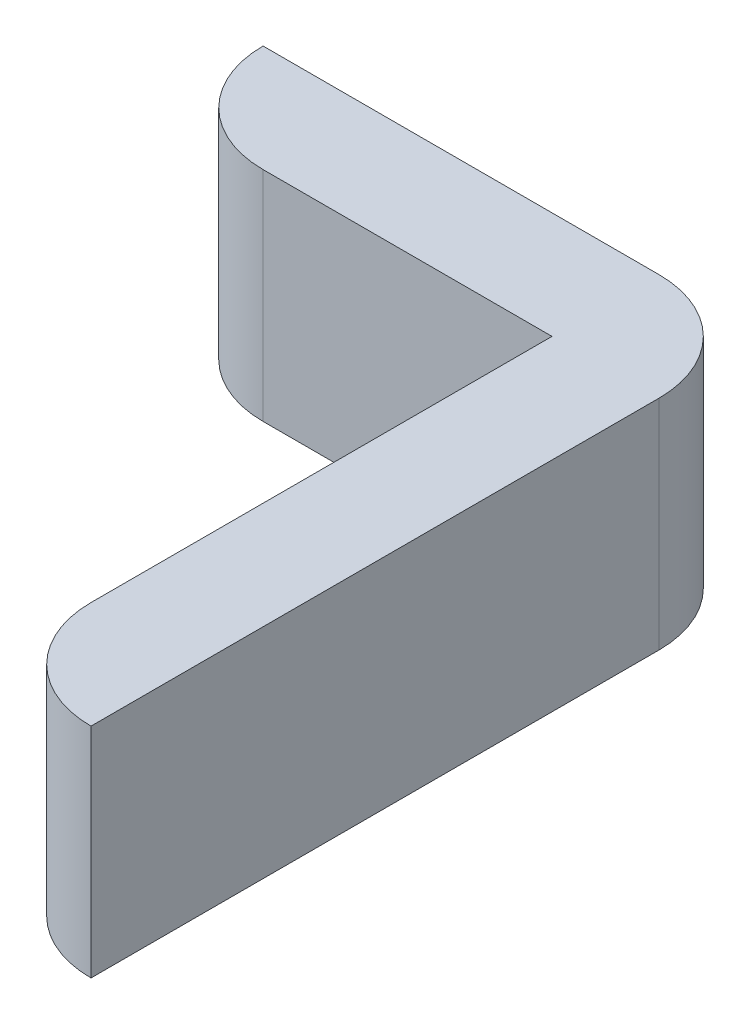
ISO-10303-21;
HEADER;
FILE_DESCRIPTION(('STEP AP214'),'2;1');
FILE_NAME('part.step','',(''),(''),'','','');
FILE_SCHEMA(('AUTOMOTIVE_DESIGN { 1 0 10303 214 1 1 1 1 }'));
ENDSEC;
DATA;
#1=APPLICATION_CONTEXT('core data for automotive mechanical design processes');
#2=APPLICATION_PROTOCOL_DEFINITION('international standard','automotive_design',2000,#1);
#3=PRODUCT_CONTEXT('',#1,'mechanical');
#4=PRODUCT('Part','Part','',(#3));
#5=PRODUCT_RELATED_PRODUCT_CATEGORY('part','',(#4));
#6=PRODUCT_DEFINITION_FORMATION('','',#4);
#7=PRODUCT_DEFINITION_CONTEXT('part definition',#1,'design');
#8=PRODUCT_DEFINITION('design','',#6,#7);
#9=PRODUCT_DEFINITION_SHAPE('','',#8);
#10=(LENGTH_UNIT() NAMED_UNIT(*) SI_UNIT(.MILLI.,.METRE.));
#11=(NAMED_UNIT(*) PLANE_ANGLE_UNIT() SI_UNIT($,.RADIAN.));
#12=(NAMED_UNIT(*) SI_UNIT($,.STERADIAN.) SOLID_ANGLE_UNIT());
#13=UNCERTAINTY_MEASURE_WITH_UNIT(LENGTH_MEASURE(1.E-05),#10,'distance_accuracy_value','');
#14=(GEOMETRIC_REPRESENTATION_CONTEXT(3) GLOBAL_UNCERTAINTY_ASSIGNED_CONTEXT((#13)) GLOBAL_UNIT_ASSIGNED_CONTEXT((#10,
#11,#12)) REPRESENTATION_CONTEXT('',''));
#15=CARTESIAN_POINT('',(0.,0.,0.));
#16=DIRECTION('',(0.,0.,1.));
#17=DIRECTION('',(1.,0.,0.));
#18=AXIS2_PLACEMENT_3D('',#15,#16,#17);
#19=CARTESIAN_POINT('',(-0.125,5.3348,0.));
#20=DIRECTION('',(0.,-1.,0.));
#21=DIRECTION('',(0.,0.,-1.));
#22=AXIS2_PLACEMENT_3D('',#19,#20,#21);
#23=PLANE('',#22);
#24=DIRECTION('',(-1.,0.,0.));
#25=VECTOR('',#24,1.);
#26=CARTESIAN_POINT('',(0.125,5.3348,0.25));
#27=LINE('',#26,#25);
#28=CARTESIAN_POINT('',(0.125,5.3348,0.25));
#29=VERTEX_POINT('',#28);
#30=CARTESIAN_POINT('',(0.8,5.3348,0.25));
#31=VERTEX_POINT('',#30);
#32=EDGE_CURVE('E102',#29,#31,#27,.F.);
#33=ORIENTED_EDGE('',*,*,#32,.T.);
#34=DIRECTION('',(0.,0.,-1.));
#35=VECTOR('',#34,1.);
#36=CARTESIAN_POINT('',(0.8,5.3348,0.25));
#37=LINE('',#36,#35);
#38=CARTESIAN_POINT('',(0.8,5.3348,1.327));
#39=VERTEX_POINT('',#38);
#40=EDGE_CURVE('E108',#31,#39,#37,.F.);
#41=ORIENTED_EDGE('',*,*,#40,.T.);
#42=CARTESIAN_POINT('',(1.05,5.3348,1.327));
#43=DIRECTION('',(0.,-1.,0.));
#44=DIRECTION('',(0.,0.,-1.));
#45=AXIS2_PLACEMENT_3D('',#42,#43,#44);
#46=CIRCLE('',#45,0.25);
#47=CARTESIAN_POINT('',(1.05,5.3348,1.577));
#48=VERTEX_POINT('',#47);
#49=EDGE_CURVE('E80',#48,#39,#46,.T.);
#50=ORIENTED_EDGE('',*,*,#49,.F.);
#51=DIRECTION('',(0.,0.,1.));
#52=VECTOR('',#51,1.);
#53=CARTESIAN_POINT('',(1.05,5.3348,1.577));
#54=LINE('',#53,#52);
#55=CARTESIAN_POINT('',(1.05,5.3348,0.25));
#56=VERTEX_POINT('',#55);
#57=EDGE_CURVE('E75',#48,#56,#54,.F.);
#58=ORIENTED_EDGE('',*,*,#57,.T.);
#59=CARTESIAN_POINT('',(0.8,5.3348,0.25));
#60=DIRECTION('',(0.,-1.,0.));
#61=DIRECTION('',(0.,0.,-1.));
#62=AXIS2_PLACEMENT_3D('',#59,#60,#61);
#63=CIRCLE('',#62,0.25);
#64=CARTESIAN_POINT('',(0.8,5.3348,0.));
#65=VERTEX_POINT('',#64);
#66=EDGE_CURVE('E19',#65,#56,#63,.T.);
#67=ORIENTED_EDGE('',*,*,#66,.F.);
#68=DIRECTION('',(1.,0.,0.));
#69=VECTOR('',#68,1.);
#70=CARTESIAN_POINT('',(0.8,5.3348,0.));
#71=LINE('',#70,#69);
#72=CARTESIAN_POINT('',(-0.125,5.3348,0.));
#73=VERTEX_POINT('',#72);
#74=EDGE_CURVE('E70',#65,#73,#71,.F.);
#75=ORIENTED_EDGE('',*,*,#74,.T.);
#76=CARTESIAN_POINT('',(0.125,5.3348,0.));
#77=DIRECTION('',(0.,-1.,0.));
#78=DIRECTION('',(0.,0.,-1.));
#79=AXIS2_PLACEMENT_3D('',#76,#77,#78);
#80=CIRCLE('',#79,0.25);
#81=EDGE_CURVE('E121',#29,#73,#80,.T.);
#82=ORIENTED_EDGE('',*,*,#81,.F.);
#83=EDGE_LOOP('',(#33,#41,#50,#58,#67,#75,#82));
#84=FACE_BOUND('',#83,.T.);
#85=ADVANCED_FACE('F16',(#84),#23,.F.);
#86=CARTESIAN_POINT('',(0.8,4.8252,0.));
#87=DIRECTION('',(0.,0.,1.));
#88=DIRECTION('',(1.,0.,0.));
#89=AXIS2_PLACEMENT_3D('',#86,#87,#88);
#90=PLANE('',#89);
#91=DIRECTION('',(0.,-1.,0.));
#92=VECTOR('',#91,1.);
#93=CARTESIAN_POINT('',(-0.125,4.8252,0.));
#94=LINE('',#93,#92);
#95=CARTESIAN_POINT('',(-0.125,4.8252,0.));
#96=VERTEX_POINT('',#95);
#97=EDGE_CURVE('E123',#73,#96,#94,.T.);
#98=ORIENTED_EDGE('',*,*,#97,.F.);
#99=ORIENTED_EDGE('',*,*,#74,.F.);
#100=DIRECTION('',(0.,-1.,0.));
#101=VECTOR('',#100,1.);
#102=CARTESIAN_POINT('',(0.8,4.8252,0.));
#103=LINE('',#102,#101);
#104=CARTESIAN_POINT('',(0.8,4.8252,0.));
#105=VERTEX_POINT('',#104);
#106=EDGE_CURVE('E92',#105,#65,#103,.F.);
#107=ORIENTED_EDGE('',*,*,#106,.F.);
#108=DIRECTION('',(1.,0.,0.));
#109=VECTOR('',#108,1.);
#110=CARTESIAN_POINT('',(-0.125,4.8252,0.));
#111=LINE('',#110,#109);
#112=EDGE_CURVE('E120',#96,#105,#111,.T.);
#113=ORIENTED_EDGE('',*,*,#112,.F.);
#114=EDGE_LOOP('',(#98,#99,#107,#113));
#115=FACE_BOUND('',#114,.T.);
#116=ADVANCED_FACE('F158',(#115),#90,.F.);
#117=CARTESIAN_POINT('',(0.8,4.8252,0.25));
#118=DIRECTION('',(0.,-1.,0.));
#119=DIRECTION('',(0.,0.,-1.));
#120=AXIS2_PLACEMENT_3D('',#117,#118,#119);
#121=CYLINDRICAL_SURFACE('',#120,0.25);
#122=ORIENTED_EDGE('',*,*,#66,.T.);
#123=DIRECTION('',(0.,1.,0.));
#124=VECTOR('',#123,1.);
#125=CARTESIAN_POINT('',(1.05,4.8252,0.25));
#126=LINE('',#125,#124);
#127=CARTESIAN_POINT('',(1.05,4.8252,0.25));
#128=VERTEX_POINT('',#127);
#129=EDGE_CURVE('E86',#56,#128,#126,.F.);
#130=ORIENTED_EDGE('',*,*,#129,.T.);
#131=CARTESIAN_POINT('',(0.8,4.8252,0.25));
#132=DIRECTION('',(0.,-1.,0.));
#133=DIRECTION('',(0.,0.,-1.));
#134=AXIS2_PLACEMENT_3D('',#131,#132,#133);
#135=CIRCLE('',#134,0.25);
#136=EDGE_CURVE('E118',#105,#128,#135,.T.);
#137=ORIENTED_EDGE('',*,*,#136,.F.);
#138=ORIENTED_EDGE('',*,*,#106,.T.);
#139=EDGE_LOOP('',(#122,#130,#137,#138));
#140=FACE_BOUND('',#139,.T.);
#141=ADVANCED_FACE('F89',(#140),#121,.T.);
#142=CARTESIAN_POINT('',(1.05,4.8252,1.577));
#143=DIRECTION('',(-1.,0.,0.));
#144=DIRECTION('',(0.,0.,1.));
#145=AXIS2_PLACEMENT_3D('',#142,#143,#144);
#146=PLANE('',#145);
#147=DIRECTION('',(0.,-1.,0.));
#148=VECTOR('',#147,1.);
#149=CARTESIAN_POINT('',(1.05,4.8252,1.577));
#150=LINE('',#149,#148);
#151=CARTESIAN_POINT('',(1.05,4.8252,1.577));
#152=VERTEX_POINT('',#151);
#153=EDGE_CURVE('E85',#152,#48,#150,.F.);
#154=ORIENTED_EDGE('',*,*,#153,.F.);
#155=DIRECTION('',(0.,0.,-1.));
#156=VECTOR('',#155,1.);
#157=CARTESIAN_POINT('',(1.05,4.8252,0.));
#158=LINE('',#157,#156);
#159=EDGE_CURVE('E94',#128,#152,#158,.F.);
#160=ORIENTED_EDGE('',*,*,#159,.F.);
#161=ORIENTED_EDGE('',*,*,#129,.F.);
#162=ORIENTED_EDGE('',*,*,#57,.F.);
#163=EDGE_LOOP('',(#154,#160,#161,#162));
#164=FACE_BOUND('',#163,.T.);
#165=ADVANCED_FACE('F93',(#164),#146,.F.);
#166=CARTESIAN_POINT('',(1.05,4.8252,1.327));
#167=DIRECTION('',(0.,-1.,0.));
#168=DIRECTION('',(0.,0.,-1.));
#169=AXIS2_PLACEMENT_3D('',#166,#167,#168);
#170=CYLINDRICAL_SURFACE('',#169,0.25);
#171=ORIENTED_EDGE('',*,*,#49,.T.);
#172=DIRECTION('',(0.,1.,0.));
#173=VECTOR('',#172,1.);
#174=CARTESIAN_POINT('',(0.8,4.8252,1.327));
#175=LINE('',#174,#173);
#176=CARTESIAN_POINT('',(0.8,4.8252,1.327));
#177=VERTEX_POINT('',#176);
#178=EDGE_CURVE('E105',#39,#177,#175,.F.);
#179=ORIENTED_EDGE('',*,*,#178,.T.);
#180=CARTESIAN_POINT('',(1.05,4.8252,1.327));
#181=DIRECTION('',(0.,-1.,0.));
#182=DIRECTION('',(0.,0.,-1.));
#183=AXIS2_PLACEMENT_3D('',#180,#181,#182);
#184=CIRCLE('',#183,0.25);
#185=EDGE_CURVE('E114',#152,#177,#184,.T.);
#186=ORIENTED_EDGE('',*,*,#185,.F.);
#187=ORIENTED_EDGE('',*,*,#153,.T.);
#188=EDGE_LOOP('',(#171,#179,#186,#187));
#189=FACE_BOUND('',#188,.T.);
#190=ADVANCED_FACE('F127',(#189),#170,.T.);
#191=CARTESIAN_POINT('',(0.8,4.8252,0.25));
#192=DIRECTION('',(1.,0.,0.));
#193=DIRECTION('',(0.,0.,-1.));
#194=AXIS2_PLACEMENT_3D('',#191,#192,#193);
#195=PLANE('',#194);
#196=ORIENTED_EDGE('',*,*,#178,.F.);
#197=ORIENTED_EDGE('',*,*,#40,.F.);
#198=DIRECTION('',(0.,1.,0.));
#199=VECTOR('',#198,1.);
#200=CARTESIAN_POINT('',(0.8,4.8252,0.25));
#201=LINE('',#200,#199);
#202=CARTESIAN_POINT('',(0.8,4.8252,0.25));
#203=VERTEX_POINT('',#202);
#204=EDGE_CURVE('E104',#31,#203,#201,.F.);
#205=ORIENTED_EDGE('',*,*,#204,.T.);
#206=DIRECTION('',(0.,0.,-1.));
#207=VECTOR('',#206,1.);
#208=CARTESIAN_POINT('',(0.8,4.8252,0.));
#209=LINE('',#208,#207);
#210=EDGE_CURVE('E117',#177,#203,#209,.T.);
#211=ORIENTED_EDGE('',*,*,#210,.F.);
#212=EDGE_LOOP('',(#196,#197,#205,#211));
#213=FACE_BOUND('',#212,.T.);
#214=ADVANCED_FACE('F150',(#213),#195,.F.);
#215=CARTESIAN_POINT('',(0.125,4.8252,0.25));
#216=DIRECTION('',(0.,0.,-1.));
#217=DIRECTION('',(-1.,0.,0.));
#218=AXIS2_PLACEMENT_3D('',#215,#216,#217);
#219=PLANE('',#218);
#220=ORIENTED_EDGE('',*,*,#204,.F.);
#221=ORIENTED_EDGE('',*,*,#32,.F.);
#222=DIRECTION('',(0.,-1.,0.));
#223=VECTOR('',#222,1.);
#224=CARTESIAN_POINT('',(0.125,4.8252,0.25));
#225=LINE('',#224,#223);
#226=CARTESIAN_POINT('',(0.125,4.8252,0.25));
#227=VERTEX_POINT('',#226);
#228=EDGE_CURVE('E34',#227,#29,#225,.F.);
#229=ORIENTED_EDGE('',*,*,#228,.F.);
#230=DIRECTION('',(1.,0.,0.));
#231=VECTOR('',#230,1.);
#232=CARTESIAN_POINT('',(-0.125,4.8252,0.25));
#233=LINE('',#232,#231);
#234=EDGE_CURVE('E25',#203,#227,#233,.F.);
#235=ORIENTED_EDGE('',*,*,#234,.F.);
#236=EDGE_LOOP('',(#220,#221,#229,#235));
#237=FACE_BOUND('',#236,.T.);
#238=ADVANCED_FACE('F151',(#237),#219,.F.);
#239=CARTESIAN_POINT('',(0.125,4.8252,0.));
#240=DIRECTION('',(0.,-1.,0.));
#241=DIRECTION('',(0.,0.,-1.));
#242=AXIS2_PLACEMENT_3D('',#239,#240,#241);
#243=CYLINDRICAL_SURFACE('',#242,0.25);
#244=ORIENTED_EDGE('',*,*,#81,.T.);
#245=ORIENTED_EDGE('',*,*,#97,.T.);
#246=CARTESIAN_POINT('',(0.125,4.8252,0.));
#247=DIRECTION('',(0.,-1.,0.));
#248=DIRECTION('',(0.,0.,-1.));
#249=AXIS2_PLACEMENT_3D('',#246,#247,#248);
#250=CIRCLE('',#249,0.25);
#251=EDGE_CURVE('E11',#227,#96,#250,.T.);
#252=ORIENTED_EDGE('',*,*,#251,.F.);
#253=ORIENTED_EDGE('',*,*,#228,.T.);
#254=EDGE_LOOP('',(#244,#245,#252,#253));
#255=FACE_BOUND('',#254,.T.);
#256=ADVANCED_FACE('F156',(#255),#243,.T.);
#257=CARTESIAN_POINT('',(-0.125,4.8252,0.));
#258=DIRECTION('',(0.,-1.,0.));
#259=DIRECTION('',(0.,0.,-1.));
#260=AXIS2_PLACEMENT_3D('',#257,#258,#259);
#261=PLANE('',#260);
#262=ORIENTED_EDGE('',*,*,#234,.T.);
#263=ORIENTED_EDGE('',*,*,#251,.T.);
#264=ORIENTED_EDGE('',*,*,#112,.T.);
#265=ORIENTED_EDGE('',*,*,#136,.T.);
#266=ORIENTED_EDGE('',*,*,#159,.T.);
#267=ORIENTED_EDGE('',*,*,#185,.T.);
#268=ORIENTED_EDGE('',*,*,#210,.T.);
#269=EDGE_LOOP('',(#262,#263,#264,#265,#266,#267,#268));
#270=FACE_BOUND('',#269,.T.);
#271=ADVANCED_FACE('F132',(#270),#261,.T.);
#272=CLOSED_SHELL('',(#85,#116,#141,#165,#190,#214,#238,#256,#271));
#273=MANIFOLD_SOLID_BREP('B1',#272);
#274=ADVANCED_BREP_SHAPE_REPRESENTATION('',(#18,#273),#14);
#275=SHAPE_DEFINITION_REPRESENTATION(#9,#274);
ENDSEC;
END-ISO-10303-21;
